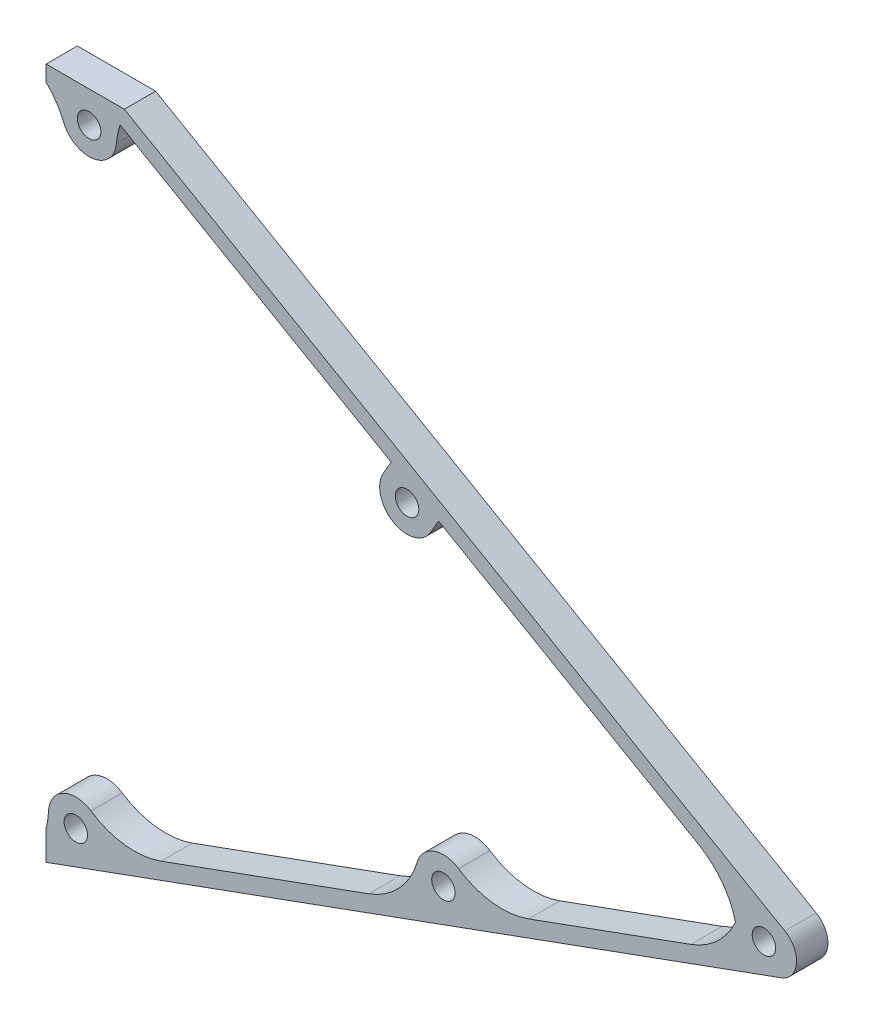
ISO-10303-21;
HEADER;
FILE_DESCRIPTION(('STEP AP214'),'2;1');
FILE_NAME('part.step','',(''),(''),'','','');
FILE_SCHEMA(('AUTOMOTIVE_DESIGN { 1 0 10303 214 1 1 1 1 }'));
ENDSEC;
DATA;
#1=APPLICATION_CONTEXT('core data for automotive mechanical design processes');
#2=APPLICATION_PROTOCOL_DEFINITION('international standard','automotive_design',2000,#1);
#3=PRODUCT_CONTEXT('',#1,'mechanical');
#4=PRODUCT('Part','Part','',(#3));
#5=PRODUCT_RELATED_PRODUCT_CATEGORY('part','',(#4));
#6=PRODUCT_DEFINITION_FORMATION('','',#4);
#7=PRODUCT_DEFINITION_CONTEXT('part definition',#1,'design');
#8=PRODUCT_DEFINITION('design','',#6,#7);
#9=PRODUCT_DEFINITION_SHAPE('','',#8);
#10=(LENGTH_UNIT() NAMED_UNIT(*) SI_UNIT(.MILLI.,.METRE.));
#11=(NAMED_UNIT(*) PLANE_ANGLE_UNIT() SI_UNIT($,.RADIAN.));
#12=(NAMED_UNIT(*) SI_UNIT($,.STERADIAN.) SOLID_ANGLE_UNIT());
#13=UNCERTAINTY_MEASURE_WITH_UNIT(LENGTH_MEASURE(1.E-05),#10,'distance_accuracy_value','');
#14=(GEOMETRIC_REPRESENTATION_CONTEXT(3) GLOBAL_UNCERTAINTY_ASSIGNED_CONTEXT((#13)) GLOBAL_UNIT_ASSIGNED_CONTEXT((#10,
#11,#12)) REPRESENTATION_CONTEXT('',''));
#15=CARTESIAN_POINT('',(0.,0.,0.));
#16=DIRECTION('',(0.,0.,1.));
#17=DIRECTION('',(1.,0.,0.));
#18=AXIS2_PLACEMENT_3D('',#15,#16,#17);
#19=CARTESIAN_POINT('',(-61.,61.2679491924311,4.));
#20=DIRECTION('',(0.5,0.866025403784439,0.));
#21=DIRECTION('',(-0.866025403784439,0.5,0.));
#22=AXIS2_PLACEMENT_3D('',#19,#20,#21);
#23=PLANE('',#22);
#24=DIRECTION('',(0.,0.,-1.));
#25=VECTOR('',#24,1.);
#26=CARTESIAN_POINT('',(-25.8948822334847,41.,14.2696803114159));
#27=LINE('',#26,#25);
#28=CARTESIAN_POINT('',(-25.8948822334847,41.,4.));
#29=VERTEX_POINT('',#28);
#30=CARTESIAN_POINT('',(-25.8948822334847,41.,0.));
#31=VERTEX_POINT('',#30);
#32=EDGE_CURVE('E357',#29,#31,#27,.T.);
#33=ORIENTED_EDGE('',*,*,#32,.F.);
#34=DIRECTION('',(0.866025403784439,-0.5,0.));
#35=VECTOR('',#34,1.);
#36=CARTESIAN_POINT('',(-61.,61.2679491924311,4.));
#37=LINE('',#36,#35);
#38=CARTESIAN_POINT('',(-60.5358983848622,61.,4.));
#39=VERTEX_POINT('',#38);
#40=EDGE_CURVE('E409',#39,#29,#37,.T.);
#41=ORIENTED_EDGE('',*,*,#40,.F.);
#42=DIRECTION('',(0.,0.,-1.));
#43=VECTOR('',#42,1.);
#44=CARTESIAN_POINT('',(-60.5358983848622,61.,4.));
#45=LINE('',#44,#43);
#46=CARTESIAN_POINT('',(-60.5358983848622,61.,0.));
#47=VERTEX_POINT('',#46);
#48=EDGE_CURVE('E412',#39,#47,#45,.T.);
#49=ORIENTED_EDGE('',*,*,#48,.T.);
#50=DIRECTION('',(0.866025403784439,-0.5,0.));
#51=VECTOR('',#50,1.);
#52=CARTESIAN_POINT('',(-61.,61.2679491924311,0.));
#53=LINE('',#52,#51);
#54=EDGE_CURVE('E397',#47,#31,#53,.T.);
#55=ORIENTED_EDGE('',*,*,#54,.T.);
#56=EDGE_LOOP('',(#33,#41,#49,#55));
#57=FACE_BOUND('',#56,.T.);
#58=ADVANCED_FACE('F58',(#57),#23,.F.);
#59=CARTESIAN_POINT('',(-19.8327044069936,37.5,0.));
#60=VERTEX_POINT('',#59);
#61=CARTESIAN_POINT('',(13.4168577865727,18.3033563171073,0.));
#62=VERTEX_POINT('',#61);
#63=EDGE_CURVE('E422',#60,#62,#53,.T.);
#64=ORIENTED_EDGE('',*,*,#63,.T.);
#65=DIRECTION('',(0.,0.,-1.));
#66=VECTOR('',#65,1.);
#67=CARTESIAN_POINT('',(13.4168577865727,18.3033563171073,4.));
#68=LINE('',#67,#66);
#69=CARTESIAN_POINT('',(13.4168577865727,18.3033563171073,4.));
#70=VERTEX_POINT('',#69);
#71=EDGE_CURVE('E254',#62,#70,#68,.F.);
#72=ORIENTED_EDGE('',*,*,#71,.T.);
#73=CARTESIAN_POINT('',(-19.8327044069936,37.5,4.));
#74=VERTEX_POINT('',#73);
#75=EDGE_CURVE('E408',#74,#70,#37,.T.);
#76=ORIENTED_EDGE('',*,*,#75,.F.);
#77=DIRECTION('',(0.,0.,-1.));
#78=VECTOR('',#77,1.);
#79=CARTESIAN_POINT('',(-19.8327044069936,37.5,14.2696803114159));
#80=LINE('',#79,#78);
#81=EDGE_CURVE('E354',#74,#60,#80,.T.);
#82=ORIENTED_EDGE('',*,*,#81,.T.);
#83=EDGE_LOOP('',(#64,#72,#76,#82));
#84=FACE_BOUND('',#83,.T.);
#85=ADVANCED_FACE('F471',(#84),#23,.F.);
#86=CARTESIAN_POINT('',(29.3159597133487,12.9178610145055,4.));
#87=DIRECTION('',(0.34202014332567,-0.939692620785908,0.));
#88=DIRECTION('',(0.939692620785908,0.34202014332567,0.));
#89=AXIS2_PLACEMENT_3D('',#86,#87,#88);
#90=PLANE('',#89);
#91=DIRECTION('',(-0.939692620785908,-0.34202014332567,0.));
#92=VECTOR('',#91,1.);
#93=CARTESIAN_POINT('',(29.3159597133487,12.9178610145055,4.));
#94=LINE('',#93,#92);
#95=CARTESIAN_POINT('',(-28.7495819952437,-8.21626780396493,4.));
#96=VERTEX_POINT('',#95);
#97=CARTESIAN_POINT('',(-55.2972487101186,-17.878828277399,4.));
#98=VERTEX_POINT('',#97);
#99=EDGE_CURVE('E393',#96,#98,#94,.T.);
#100=ORIENTED_EDGE('',*,*,#99,.F.);
#101=DIRECTION('',(0.,0.,-1.));
#102=VECTOR('',#101,1.);
#103=CARTESIAN_POINT('',(-28.7495819952437,-8.21626780396493,4.));
#104=LINE('',#103,#102);
#105=CARTESIAN_POINT('',(-28.7495819952437,-8.21626780396493,0.));
#106=VERTEX_POINT('',#105);
#107=EDGE_CURVE('E268',#96,#106,#104,.T.);
#108=ORIENTED_EDGE('',*,*,#107,.T.);
#109=DIRECTION('',(-0.939692620785908,-0.34202014332567,0.));
#110=VECTOR('',#109,1.);
#111=CARTESIAN_POINT('',(29.3159597133487,12.9178610145055,0.));
#112=LINE('',#111,#110);
#113=CARTESIAN_POINT('',(-55.2972487101186,-17.878828277399,0.));
#114=VERTEX_POINT('',#113);
#115=EDGE_CURVE('E392',#106,#114,#112,.T.);
#116=ORIENTED_EDGE('',*,*,#115,.T.);
#117=DIRECTION('',(0.,0.,-1.));
#118=VECTOR('',#117,1.);
#119=CARTESIAN_POINT('',(-55.2972487101186,-17.878828277399,4.));
#120=LINE('',#119,#118);
#121=EDGE_CURVE('E266',#114,#98,#120,.F.);
#122=ORIENTED_EDGE('',*,*,#121,.T.);
#123=EDGE_LOOP('',(#100,#108,#116,#122));
#124=FACE_BOUND('',#123,.T.);
#125=ADVANCED_FACE('F501',(#124),#90,.F.);
#126=CARTESIAN_POINT('',(12.4072597114491,6.76359751367714,4.));
#127=VERTEX_POINT('',#126);
#128=CARTESIAN_POINT('',(-8.31261767082319,-0.777821111115523,4.));
#129=VERTEX_POINT('',#128);
#130=EDGE_CURVE('E396',#127,#129,#94,.T.);
#131=ORIENTED_EDGE('',*,*,#130,.F.);
#132=DIRECTION('',(0.,0.,-1.));
#133=VECTOR('',#132,1.);
#134=CARTESIAN_POINT('',(12.4072597114491,6.76359751367714,4.));
#135=LINE('',#134,#133);
#136=CARTESIAN_POINT('',(12.4072597114491,6.76359751367714,0.));
#137=VERTEX_POINT('',#136);
#138=EDGE_CURVE('E259',#127,#137,#135,.T.);
#139=ORIENTED_EDGE('',*,*,#138,.T.);
#140=CARTESIAN_POINT('',(-8.31261767082319,-0.777821111115523,0.));
#141=VERTEX_POINT('',#140);
#142=EDGE_CURVE('E234',#137,#141,#112,.T.);
#143=ORIENTED_EDGE('',*,*,#142,.T.);
#144=DIRECTION('',(0.,0.,-1.));
#145=VECTOR('',#144,1.);
#146=CARTESIAN_POINT('',(-8.31261767082319,-0.777821111115523,4.));
#147=LINE('',#146,#145);
#148=EDGE_CURVE('E257',#141,#129,#147,.F.);
#149=ORIENTED_EDGE('',*,*,#148,.T.);
#150=EDGE_LOOP('',(#131,#139,#143,#149));
#151=FACE_BOUND('',#150,.T.);
#152=ADVANCED_FACE('F484',(#151),#90,.F.);
#153=CARTESIAN_POINT('',(30.,11.0384757729337,4.));
#154=DIRECTION('',(0.34202014332567,-0.939692620785908,0.));
#155=DIRECTION('',(0.939692620785908,0.34202014332567,0.));
#156=AXIS2_PLACEMENT_3D('',#153,#154,#155);
#157=PLANE('',#156);
#158=DIRECTION('',(-0.939692620785908,-0.34202014332567,0.));
#159=VECTOR('',#158,1.);
#160=CARTESIAN_POINT('',(30.,11.0384757729337,0.));
#161=LINE('',#160,#159);
#162=CARTESIAN_POINT('',(23.9544680147186,8.83808207998699,0.));
#163=VERTEX_POINT('',#162);
#164=CARTESIAN_POINT('',(-70.,-25.3585476536867,0.));
#165=VERTEX_POINT('',#164);
#166=EDGE_CURVE('E226',#163,#165,#161,.T.);
#167=ORIENTED_EDGE('',*,*,#166,.F.);
#168=DIRECTION('',(0.,0.,-1.));
#169=VECTOR('',#168,1.);
#170=CARTESIAN_POINT('',(23.9544680147186,8.83808207998699,4.));
#171=LINE('',#170,#169);
#172=CARTESIAN_POINT('',(23.9544680147186,8.83808207998699,4.));
#173=VERTEX_POINT('',#172);
#174=EDGE_CURVE('E250',#163,#173,#171,.F.);
#175=ORIENTED_EDGE('',*,*,#174,.T.);
#176=DIRECTION('',(-0.939692620785908,-0.34202014332567,0.));
#177=VECTOR('',#176,1.);
#178=CARTESIAN_POINT('',(30.,11.0384757729337,4.));
#179=LINE('',#178,#177);
#180=CARTESIAN_POINT('',(-70.,-25.3585476536867,4.));
#181=VERTEX_POINT('',#180);
#182=EDGE_CURVE('E239',#173,#181,#179,.T.);
#183=ORIENTED_EDGE('',*,*,#182,.T.);
#184=DIRECTION('',(0.,0.,-1.));
#185=VECTOR('',#184,1.);
#186=CARTESIAN_POINT('',(-70.,-25.3585476536867,4.));
#187=LINE('',#186,#185);
#188=EDGE_CURVE('E220',#181,#165,#187,.T.);
#189=ORIENTED_EDGE('',*,*,#188,.T.);
#190=EDGE_LOOP('',(#167,#175,#183,#189));
#191=FACE_BOUND('',#190,.T.);
#192=ADVANCED_FACE('F237',(#191),#157,.T.);
#193=CARTESIAN_POINT('',(-60.,63.,4.));
#194=DIRECTION('',(0.5,0.866025403784439,0.));
#195=DIRECTION('',(-0.866025403784439,0.5,0.));
#196=AXIS2_PLACEMENT_3D('',#193,#194,#195);
#197=PLANE('',#196);
#198=DIRECTION('',(0.866025403784439,-0.5,0.));
#199=VECTOR('',#198,1.);
#200=CARTESIAN_POINT('',(-60.,63.,4.));
#201=LINE('',#200,#199);
#202=CARTESIAN_POINT('',(-60.,63.,4.));
#203=VERTEX_POINT('',#202);
#204=CARTESIAN_POINT('',(24.4284075847416,14.255236153698,4.));
#205=VERTEX_POINT('',#204);
#206=EDGE_CURVE('E399',#203,#205,#201,.T.);
#207=ORIENTED_EDGE('',*,*,#206,.T.);
#208=DIRECTION('',(0.,0.,-1.));
#209=VECTOR('',#208,1.);
#210=CARTESIAN_POINT('',(24.4284075847416,14.255236153698,4.));
#211=LINE('',#210,#209);
#212=CARTESIAN_POINT('',(24.4284075847416,14.255236153698,0.));
#213=VERTEX_POINT('',#212);
#214=EDGE_CURVE('E240',#205,#213,#211,.T.);
#215=ORIENTED_EDGE('',*,*,#214,.T.);
#216=DIRECTION('',(0.866025403784439,-0.5,0.));
#217=VECTOR('',#216,1.);
#218=CARTESIAN_POINT('',(-60.,63.,0.));
#219=LINE('',#218,#217);
#220=CARTESIAN_POINT('',(-60.,63.,0.));
#221=VERTEX_POINT('',#220);
#222=EDGE_CURVE('E233',#221,#213,#219,.T.);
#223=ORIENTED_EDGE('',*,*,#222,.F.);
#224=DIRECTION('',(0.,0.,-1.));
#225=VECTOR('',#224,1.);
#226=CARTESIAN_POINT('',(-60.,63.,4.));
#227=LINE('',#226,#225);
#228=EDGE_CURVE('E241',#203,#221,#227,.T.);
#229=ORIENTED_EDGE('',*,*,#228,.F.);
#230=EDGE_LOOP('',(#207,#215,#223,#229));
#231=FACE_BOUND('',#230,.T.);
#232=ADVANCED_FACE('F522',(#231),#197,.T.);
#233=CARTESIAN_POINT('',(-60.,63.,4.));
#234=DIRECTION('',(0.,1.,0.));
#235=DIRECTION('',(0.,0.,1.));
#236=AXIS2_PLACEMENT_3D('',#233,#234,#235);
#237=PLANE('',#236);
#238=DIRECTION('',(1.,0.,0.));
#239=VECTOR('',#238,1.);
#240=CARTESIAN_POINT('',(-60.,63.,0.));
#241=LINE('',#240,#239);
#242=CARTESIAN_POINT('',(-70.,63.,0.));
#243=VERTEX_POINT('',#242);
#244=EDGE_CURVE('E416',#243,#221,#241,.T.);
#245=ORIENTED_EDGE('',*,*,#244,.F.);
#246=DIRECTION('',(0.,0.,-1.));
#247=VECTOR('',#246,1.);
#248=CARTESIAN_POINT('',(-70.,63.,4.));
#249=LINE('',#248,#247);
#250=CARTESIAN_POINT('',(-70.,63.,4.));
#251=VERTEX_POINT('',#250);
#252=EDGE_CURVE('E245',#251,#243,#249,.T.);
#253=ORIENTED_EDGE('',*,*,#252,.F.);
#254=DIRECTION('',(1.,0.,0.));
#255=VECTOR('',#254,1.);
#256=CARTESIAN_POINT('',(-60.,63.,4.));
#257=LINE('',#256,#255);
#258=EDGE_CURVE('E402',#251,#203,#257,.T.);
#259=ORIENTED_EDGE('',*,*,#258,.T.);
#260=ORIENTED_EDGE('',*,*,#228,.T.);
#261=EDGE_LOOP('',(#245,#253,#259,#260));
#262=FACE_BOUND('',#261,.T.);
#263=ADVANCED_FACE('F435',(#262),#237,.T.);
#264=CARTESIAN_POINT('',(-70.,61.,4.));
#265=DIRECTION('',(-1.,0.,0.));
#266=DIRECTION('',(0.,0.,1.));
#267=AXIS2_PLACEMENT_3D('',#264,#265,#266);
#268=PLANE('',#267);
#269=DIRECTION('',(0.,1.,0.));
#270=VECTOR('',#269,1.);
#271=CARTESIAN_POINT('',(-70.,61.,0.));
#272=LINE('',#271,#270);
#273=CARTESIAN_POINT('',(-70.,61.,0.));
#274=VERTEX_POINT('',#273);
#275=EDGE_CURVE('E419',#274,#243,#272,.T.);
#276=ORIENTED_EDGE('',*,*,#275,.F.);
#277=DIRECTION('',(0.,0.,-1.));
#278=VECTOR('',#277,1.);
#279=CARTESIAN_POINT('',(-70.,61.,4.));
#280=LINE('',#279,#278);
#281=CARTESIAN_POINT('',(-70.,61.,4.));
#282=VERTEX_POINT('',#281);
#283=EDGE_CURVE('E426',#282,#274,#280,.T.);
#284=ORIENTED_EDGE('',*,*,#283,.F.);
#285=DIRECTION('',(0.,1.,0.));
#286=VECTOR('',#285,1.);
#287=CARTESIAN_POINT('',(-70.,61.,4.));
#288=LINE('',#287,#286);
#289=EDGE_CURVE('E405',#282,#251,#288,.T.);
#290=ORIENTED_EDGE('',*,*,#289,.T.);
#291=ORIENTED_EDGE('',*,*,#252,.T.);
#292=EDGE_LOOP('',(#276,#284,#290,#291));
#293=FACE_BOUND('',#292,.T.);
#294=ADVANCED_FACE('F431',(#293),#268,.T.);
#295=CARTESIAN_POINT('',(0.,0.,4.));
#296=DIRECTION('',(0.,0.,-1.));
#297=DIRECTION('',(-1.,0.,0.));
#298=AXIS2_PLACEMENT_3D('',#295,#296,#297);
#299=PLANE('',#298);
#300=CARTESIAN_POINT('',(-79.6867494133173,-19.125861551774,4.));
#301=DIRECTION('',(0.,0.,-1.));
#302=DIRECTION('',(-1.,0.,0.));
#303=AXIS2_PLACEMENT_3D('',#300,#301,#302);
#304=CIRCLE('',#303,10.);
#305=CARTESIAN_POINT('',(-69.6963951508454,-19.5649762410169,4.));
#306=VERTEX_POINT('',#305);
#307=CARTESIAN_POINT('',(-70.,-21.6091830781971,4.));
#308=VERTEX_POINT('',#307);
#309=EDGE_CURVE('E302',#306,#308,#304,.T.);
#310=ORIENTED_EDGE('',*,*,#309,.T.);
#311=DIRECTION('',(0.,1.,0.));
#312=VECTOR('',#311,1.);
#313=CARTESIAN_POINT('',(-70.,-25.3585476536867,4.));
#314=LINE('',#313,#312);
#315=EDGE_CURVE('E73',#181,#308,#314,.T.);
#316=ORIENTED_EDGE('',*,*,#315,.F.);
#317=ORIENTED_EDGE('',*,*,#182,.F.);
#318=CARTESIAN_POINT('',(22.9284075847416,11.6571599423447,4.));
#319=DIRECTION('',(0.,0.,-1.));
#320=DIRECTION('',(-1.,0.,0.));
#321=AXIS2_PLACEMENT_3D('',#318,#319,#320);
#322=CIRCLE('',#321,3.);
#323=EDGE_CURVE('E252',#173,#205,#322,.F.);
#324=ORIENTED_EDGE('',*,*,#323,.T.);
#325=ORIENTED_EDGE('',*,*,#206,.F.);
#326=ORIENTED_EDGE('',*,*,#258,.F.);
#327=ORIENTED_EDGE('',*,*,#289,.F.);
#328=CARTESIAN_POINT('',(-76.9708627492164,53.830127439655,4.));
#329=DIRECTION('',(0.,0.,-1.));
#330=DIRECTION('',(-1.,0.,0.));
#331=AXIS2_PLACEMENT_3D('',#328,#329,#330);
#332=CIRCLE('',#331,10.);
#333=CARTESIAN_POINT('',(-67.7331866386857,57.6596626695402,4.));
#334=VERTEX_POINT('',#333);
#335=EDGE_CURVE('E66',#282,#334,#332,.T.);
#336=ORIENTED_EDGE('',*,*,#335,.T.);
#337=CARTESIAN_POINT('',(-64.5,59.,4.));
#338=DIRECTION('',(0.,0.,-1.));
#339=DIRECTION('',(-1.,0.,0.));
#340=AXIS2_PLACEMENT_3D('',#337,#338,#339);
#341=CIRCLE('',#340,3.50000000000001);
#342=CARTESIAN_POINT('',(-61.0130920058537,58.6975555582281,4.));
#343=VERTEX_POINT('',#342);
#344=EDGE_CURVE('E326',#334,#343,#341,.F.);
#345=ORIENTED_EDGE('',*,*,#344,.T.);
#346=CARTESIAN_POINT('',(-51.0504977368643,57.8334285817369,4.));
#347=DIRECTION('',(0.,0.,-1.));
#348=DIRECTION('',(-1.,0.,0.));
#349=AXIS2_PLACEMENT_3D('',#346,#347,#348);
#350=CIRCLE('',#349,10.);
#351=EDGE_CURVE('E307',#343,#39,#350,.T.);
#352=ORIENTED_EDGE('',*,*,#351,.T.);
#353=ORIENTED_EDGE('',*,*,#40,.T.);
#354=DIRECTION('',(0.499999999999999,0.86602540378444,0.));
#355=VECTOR('',#354,1.);
#356=CARTESIAN_POINT('',(-37.1746824526945,21.4628129211019,4.));
#357=LINE('',#356,#355);
#358=CARTESIAN_POINT('',(-26.8948822334847,39.2679491924311,4.));
#359=VERTEX_POINT('',#358);
#360=EDGE_CURVE('E334',#359,#29,#357,.T.);
#361=ORIENTED_EDGE('',*,*,#360,.F.);
#362=CARTESIAN_POINT('',(-23.8637933202392,37.5179491924311,4.));
#363=DIRECTION('',(0.,0.,-1.));
#364=DIRECTION('',(-1.,0.,0.));
#365=AXIS2_PLACEMENT_3D('',#362,#363,#364);
#366=CIRCLE('',#365,3.5);
#367=CARTESIAN_POINT('',(-20.8327044069936,35.7679491924311,4.));
#368=VERTEX_POINT('',#367);
#369=EDGE_CURVE('E333',#359,#368,#366,.F.);
#370=ORIENTED_EDGE('',*,*,#369,.T.);
#371=DIRECTION('',(0.499999999999995,0.866025403784442,0.));
#372=VECTOR('',#371,1.);
#373=CARTESIAN_POINT('',(-31.1125046262034,17.9628129211018,4.));
#374=LINE('',#373,#372);
#375=EDGE_CURVE('E330',#368,#74,#374,.T.);
#376=ORIENTED_EDGE('',*,*,#375,.T.);
#377=ORIENTED_EDGE('',*,*,#75,.T.);
#378=CARTESIAN_POINT('',(8.41685778657267,9.64310227926294,4.));
#379=DIRECTION('',(0.,0.,-1.));
#380=DIRECTION('',(-1.,0.,0.));
#381=AXIS2_PLACEMENT_3D('',#378,#379,#380);
#382=CIRCLE('',#381,10.);
#383=CARTESIAN_POINT('',(18.1158409765538,12.0782049630245,4.));
#384=VERTEX_POINT('',#383);
#385=EDGE_CURVE('E80',#70,#384,#382,.T.);
#386=ORIENTED_EDGE('',*,*,#385,.T.);
#387=CARTESIAN_POINT('',(8.98705827819236,16.1605237215362,4.));
#388=DIRECTION('',(0.,0.,-1.));
#389=DIRECTION('',(-1.,0.,0.));
#390=AXIS2_PLACEMENT_3D('',#387,#388,#389);
#391=CIRCLE('',#390,10.);
#392=EDGE_CURVE('E286',#384,#127,#391,.T.);
#393=ORIENTED_EDGE('',*,*,#392,.T.);
#394=ORIENTED_EDGE('',*,*,#130,.T.);
#395=CARTESIAN_POINT('',(-11.7328191040799,8.61910509674355,4.));
#396=DIRECTION('',(0.,0.,-1.));
#397=DIRECTION('',(-1.,0.,0.));
#398=AXIS2_PLACEMENT_3D('',#395,#396,#397);
#399=CIRCLE('',#398,10.);
#400=CARTESIAN_POINT('',(-17.2752791156391,0.295575976216174,4.));
#401=VERTEX_POINT('',#400);
#402=EDGE_CURVE('E290',#129,#401,#399,.T.);
#403=ORIENTED_EDGE('',*,*,#402,.T.);
#404=CARTESIAN_POINT('',(-19.2151401196848,-2.61765921596841,4.));
#405=DIRECTION('',(0.,0.,-1.));
#406=DIRECTION('',(-1.,0.,0.));
#407=AXIS2_PLACEMENT_3D('',#404,#405,#406);
#408=CIRCLE('',#407,3.50000000000001);
#409=CARTESIAN_POINT('',(-22.5737513478963,-1.63291020341145,4.));
#410=VERTEX_POINT('',#409);
#411=EDGE_CURVE('E372',#401,#410,#408,.F.);
#412=ORIENTED_EDGE('',*,*,#411,.T.);
#413=CARTESIAN_POINT('',(-32.1697834285005,1.18065840389415,4.));
#414=DIRECTION('',(0.,0.,-1.));
#415=DIRECTION('',(-1.,0.,0.));
#416=AXIS2_PLACEMENT_3D('',#413,#414,#415);
#417=CIRCLE('',#416,10.);
#418=EDGE_CURVE('E294',#410,#96,#417,.T.);
#419=ORIENTED_EDGE('',*,*,#418,.T.);
#420=ORIENTED_EDGE('',*,*,#99,.T.);
#421=CARTESIAN_POINT('',(-58.7174501433753,-8.48190206953997,4.));
#422=DIRECTION('',(0.,0.,-1.));
#423=DIRECTION('',(-1.,0.,0.));
#424=AXIS2_PLACEMENT_3D('',#421,#422,#423);
#425=CIRCLE('',#424,10.);
#426=CARTESIAN_POINT('',(-64.2599101549345,-16.8054311900673,4.));
#427=VERTEX_POINT('',#426);
#428=EDGE_CURVE('E298',#98,#427,#425,.T.);
#429=ORIENTED_EDGE('',*,*,#428,.T.);
#430=CARTESIAN_POINT('',(-66.1997711589802,-19.7186663822519,4.));
#431=DIRECTION('',(0.,0.,-1.));
#432=DIRECTION('',(-1.,0.,0.));
#433=AXIS2_PLACEMENT_3D('',#430,#431,#432);
#434=CIRCLE('',#433,3.50000000000001);
#435=EDGE_CURVE('E384',#427,#306,#434,.F.);
#436=ORIENTED_EDGE('',*,*,#435,.T.);
#437=EDGE_LOOP('',(#310,#316,#317,#324,#325,#326,#327,#336,#345,#352,#353,#361,#370,#376,#377,
#386,#393,#394,#403,#412,#419,#420,#429,#436));
#438=FACE_BOUND('',#437,.T.);
#439=CARTESIAN_POINT('',(21.7498088488651,11.7602739705799,4.));
#440=DIRECTION('',(0.,0.,-1.));
#441=DIRECTION('',(-1.,0.,0.));
#442=AXIS2_PLACEMENT_3D('',#439,#440,#441);
#443=CIRCLE('',#442,1.5);
#444=CARTESIAN_POINT('',(20.2498088488651,11.7602739705799,4.));
#445=VERTEX_POINT('',#444);
#446=EDGE_CURVE('E363',#445,#445,#443,.F.);
#447=ORIENTED_EDGE('',*,*,#446,.F.);
#448=EDGE_LOOP('',(#447));
#449=FACE_BOUND('',#448,.T.);
#450=CARTESIAN_POINT('',(-66.1997711589802,-19.7186663822519,4.));
#451=DIRECTION('',(0.,0.,-1.));
#452=DIRECTION('',(-1.,0.,0.));
#453=AXIS2_PLACEMENT_3D('',#450,#451,#452);
#454=CIRCLE('',#453,1.5);
#455=CARTESIAN_POINT('',(-67.6997711589802,-19.7186663822519,4.));
#456=VERTEX_POINT('',#455);
#457=EDGE_CURVE('E380',#456,#456,#454,.F.);
#458=ORIENTED_EDGE('',*,*,#457,.F.);
#459=EDGE_LOOP('',(#458));
#460=FACE_BOUND('',#459,.T.);
#461=CARTESIAN_POINT('',(-19.2151401196848,-2.61765921596841,4.));
#462=DIRECTION('',(0.,0.,-1.));
#463=DIRECTION('',(-1.,0.,0.));
#464=AXIS2_PLACEMENT_3D('',#461,#462,#463);
#465=CIRCLE('',#464,1.5);
#466=CARTESIAN_POINT('',(-20.7151401196848,-2.61765921596841,4.));
#467=VERTEX_POINT('',#466);
#468=EDGE_CURVE('E366',#467,#467,#465,.F.);
#469=ORIENTED_EDGE('',*,*,#468,.F.);
#470=EDGE_LOOP('',(#469));
#471=FACE_BOUND('',#470,.T.);
#472=CARTESIAN_POINT('',(-23.8637933202392,37.5179491924311,4.));
#473=DIRECTION('',(0.,0.,-1.));
#474=DIRECTION('',(-1.,0.,0.));
#475=AXIS2_PLACEMENT_3D('',#472,#473,#474);
#476=CIRCLE('',#475,1.5);
#477=CARTESIAN_POINT('',(-25.3637933202392,37.5179491924311,4.));
#478=VERTEX_POINT('',#477);
#479=EDGE_CURVE('E336',#478,#478,#476,.F.);
#480=ORIENTED_EDGE('',*,*,#479,.F.);
#481=EDGE_LOOP('',(#480));
#482=FACE_BOUND('',#481,.T.);
#483=CARTESIAN_POINT('',(-64.5,59.,4.));
#484=DIRECTION('',(0.,0.,-1.));
#485=DIRECTION('',(-1.,0.,0.));
#486=AXIS2_PLACEMENT_3D('',#483,#484,#485);
#487=CIRCLE('',#486,1.5);
#488=CARTESIAN_POINT('',(-66.,59.,4.));
#489=VERTEX_POINT('',#488);
#490=EDGE_CURVE('E312',#489,#489,#487,.F.);
#491=ORIENTED_EDGE('',*,*,#490,.F.);
#492=EDGE_LOOP('',(#491));
#493=FACE_BOUND('',#492,.T.);
#494=ADVANCED_FACE('F447',(#438,#449,#460,#471,#482,#493),#299,.F.);
#495=CARTESIAN_POINT('',(0.,0.,0.));
#496=DIRECTION('',(0.,0.,-1.));
#497=DIRECTION('',(-1.,0.,0.));
#498=AXIS2_PLACEMENT_3D('',#495,#496,#497);
#499=PLANE('',#498);
#500=DIRECTION('',(0.,1.,0.));
#501=VECTOR('',#500,1.);
#502=CARTESIAN_POINT('',(-70.,-25.3585476536867,0.));
#503=LINE('',#502,#501);
#504=CARTESIAN_POINT('',(-70.,-21.6091830781971,0.));
#505=VERTEX_POINT('',#504);
#506=EDGE_CURVE('E216',#165,#505,#503,.T.);
#507=ORIENTED_EDGE('',*,*,#506,.T.);
#508=CARTESIAN_POINT('',(-79.6867494133173,-19.125861551774,0.));
#509=DIRECTION('',(0.,0.,-1.));
#510=DIRECTION('',(-1.,0.,0.));
#511=AXIS2_PLACEMENT_3D('',#508,#509,#510);
#512=CIRCLE('',#511,10.);
#513=CARTESIAN_POINT('',(-69.6963951508454,-19.5649762410169,0.));
#514=VERTEX_POINT('',#513);
#515=EDGE_CURVE('E300',#505,#514,#512,.F.);
#516=ORIENTED_EDGE('',*,*,#515,.T.);
#517=CARTESIAN_POINT('',(-66.1997711589802,-19.7186663822519,0.));
#518=DIRECTION('',(0.,0.,-1.));
#519=DIRECTION('',(-1.,0.,0.));
#520=AXIS2_PLACEMENT_3D('',#517,#518,#519);
#521=CIRCLE('',#520,3.50000000000001);
#522=CARTESIAN_POINT('',(-64.2599101549345,-16.8054311900673,0.));
#523=VERTEX_POINT('',#522);
#524=EDGE_CURVE('E381',#514,#523,#521,.T.);
#525=ORIENTED_EDGE('',*,*,#524,.T.);
#526=CARTESIAN_POINT('',(-58.7174501433753,-8.48190206953997,0.));
#527=DIRECTION('',(0.,0.,-1.));
#528=DIRECTION('',(-1.,0.,0.));
#529=AXIS2_PLACEMENT_3D('',#526,#527,#528);
#530=CIRCLE('',#529,10.);
#531=EDGE_CURVE('E296',#523,#114,#530,.F.);
#532=ORIENTED_EDGE('',*,*,#531,.T.);
#533=ORIENTED_EDGE('',*,*,#115,.F.);
#534=CARTESIAN_POINT('',(-32.1697834285005,1.18065840389415,0.));
#535=DIRECTION('',(0.,0.,-1.));
#536=DIRECTION('',(-1.,0.,0.));
#537=AXIS2_PLACEMENT_3D('',#534,#535,#536);
#538=CIRCLE('',#537,10.);
#539=CARTESIAN_POINT('',(-22.5737513478963,-1.63291020341145,0.));
#540=VERTEX_POINT('',#539);
#541=EDGE_CURVE('E292',#106,#540,#538,.F.);
#542=ORIENTED_EDGE('',*,*,#541,.T.);
#543=CARTESIAN_POINT('',(-19.2151401196848,-2.61765921596841,0.));
#544=DIRECTION('',(0.,0.,-1.));
#545=DIRECTION('',(-1.,0.,0.));
#546=AXIS2_PLACEMENT_3D('',#543,#544,#545);
#547=CIRCLE('',#546,3.50000000000001);
#548=CARTESIAN_POINT('',(-17.2752791156391,0.295575976216174,0.));
#549=VERTEX_POINT('',#548);
#550=EDGE_CURVE('E369',#540,#549,#547,.T.);
#551=ORIENTED_EDGE('',*,*,#550,.T.);
#552=CARTESIAN_POINT('',(-11.7328191040799,8.61910509674355,0.));
#553=DIRECTION('',(0.,0.,-1.));
#554=DIRECTION('',(-1.,0.,0.));
#555=AXIS2_PLACEMENT_3D('',#552,#553,#554);
#556=CIRCLE('',#555,10.);
#557=EDGE_CURVE('E288',#549,#141,#556,.F.);
#558=ORIENTED_EDGE('',*,*,#557,.T.);
#559=ORIENTED_EDGE('',*,*,#142,.F.);
#560=CARTESIAN_POINT('',(8.98705827819236,16.1605237215362,0.));
#561=DIRECTION('',(0.,0.,-1.));
#562=DIRECTION('',(-1.,0.,0.));
#563=AXIS2_PLACEMENT_3D('',#560,#561,#562);
#564=CIRCLE('',#563,10.);
#565=CARTESIAN_POINT('',(18.1158409765538,12.0782049630245,0.));
#566=VERTEX_POINT('',#565);
#567=EDGE_CURVE('E284',#137,#566,#564,.F.);
#568=ORIENTED_EDGE('',*,*,#567,.T.);
#569=CARTESIAN_POINT('',(8.41685778657267,9.64310227926294,0.));
#570=DIRECTION('',(0.,0.,-1.));
#571=DIRECTION('',(-1.,0.,0.));
#572=AXIS2_PLACEMENT_3D('',#569,#570,#571);
#573=CIRCLE('',#572,10.);
#574=EDGE_CURVE('E281',#566,#62,#573,.F.);
#575=ORIENTED_EDGE('',*,*,#574,.T.);
#576=ORIENTED_EDGE('',*,*,#63,.F.);
#577=DIRECTION('',(-0.499999999999995,-0.866025403784442,0.));
#578=VECTOR('',#577,1.);
#579=CARTESIAN_POINT('',(-31.1125046262034,17.9628129211018,0.));
#580=LINE('',#579,#578);
#581=CARTESIAN_POINT('',(-20.8327044069936,35.7679491924311,0.));
#582=VERTEX_POINT('',#581);
#583=EDGE_CURVE('E348',#60,#582,#580,.T.);
#584=ORIENTED_EDGE('',*,*,#583,.T.);
#585=CARTESIAN_POINT('',(-23.8637933202392,37.5179491924311,0.));
#586=DIRECTION('',(0.,0.,-1.));
#587=DIRECTION('',(-1.,0.,0.));
#588=AXIS2_PLACEMENT_3D('',#585,#586,#587);
#589=CIRCLE('',#588,3.5);
#590=CARTESIAN_POINT('',(-26.8948822334847,39.2679491924311,0.));
#591=VERTEX_POINT('',#590);
#592=EDGE_CURVE('E342',#582,#591,#589,.T.);
#593=ORIENTED_EDGE('',*,*,#592,.T.);
#594=DIRECTION('',(-0.499999999999999,-0.86602540378444,0.));
#595=VECTOR('',#594,1.);
#596=CARTESIAN_POINT('',(-37.1746824526945,21.4628129211019,0.));
#597=LINE('',#596,#595);
#598=EDGE_CURVE('E345',#31,#591,#597,.T.);
#599=ORIENTED_EDGE('',*,*,#598,.F.);
#600=ORIENTED_EDGE('',*,*,#54,.F.);
#601=CARTESIAN_POINT('',(-51.0504977368643,57.8334285817369,0.));
#602=DIRECTION('',(0.,0.,-1.));
#603=DIRECTION('',(-1.,0.,0.));
#604=AXIS2_PLACEMENT_3D('',#601,#602,#603);
#605=CIRCLE('',#604,10.);
#606=CARTESIAN_POINT('',(-61.0130920058537,58.6975555582281,0.));
#607=VERTEX_POINT('',#606);
#608=EDGE_CURVE('E305',#47,#607,#605,.F.);
#609=ORIENTED_EDGE('',*,*,#608,.T.);
#610=CARTESIAN_POINT('',(-64.5,59.,0.));
#611=DIRECTION('',(0.,0.,-1.));
#612=DIRECTION('',(-1.,0.,0.));
#613=AXIS2_PLACEMENT_3D('',#610,#611,#612);
#614=CIRCLE('',#613,3.50000000000001);
#615=CARTESIAN_POINT('',(-67.7331866386857,57.6596626695402,0.));
#616=VERTEX_POINT('',#615);
#617=EDGE_CURVE('E322',#607,#616,#614,.T.);
#618=ORIENTED_EDGE('',*,*,#617,.T.);
#619=CARTESIAN_POINT('',(-76.9708627492164,53.830127439655,0.));
#620=DIRECTION('',(0.,0.,-1.));
#621=DIRECTION('',(-1.,0.,0.));
#622=AXIS2_PLACEMENT_3D('',#619,#620,#621);
#623=CIRCLE('',#622,10.);
#624=EDGE_CURVE('E309',#616,#274,#623,.F.);
#625=ORIENTED_EDGE('',*,*,#624,.T.);
#626=ORIENTED_EDGE('',*,*,#275,.T.);
#627=ORIENTED_EDGE('',*,*,#244,.T.);
#628=ORIENTED_EDGE('',*,*,#222,.T.);
#629=CARTESIAN_POINT('',(22.9284075847416,11.6571599423447,0.));
#630=DIRECTION('',(0.,0.,-1.));
#631=DIRECTION('',(-1.,0.,0.));
#632=AXIS2_PLACEMENT_3D('',#629,#630,#631);
#633=CIRCLE('',#632,3.);
#634=EDGE_CURVE('E230',#213,#163,#633,.T.);
#635=ORIENTED_EDGE('',*,*,#634,.T.);
#636=ORIENTED_EDGE('',*,*,#166,.T.);
#637=EDGE_LOOP('',(#507,#516,#525,#532,#533,#542,#551,#558,#559,#568,#575,#576,#584,#593,#599,
#600,#609,#618,#625,#626,#627,#628,#635,#636));
#638=FACE_BOUND('',#637,.T.);
#639=CARTESIAN_POINT('',(21.7498088488651,11.7602739705799,0.));
#640=DIRECTION('',(0.,0.,-1.));
#641=DIRECTION('',(-1.,0.,0.));
#642=AXIS2_PLACEMENT_3D('',#639,#640,#641);
#643=CIRCLE('',#642,1.5);
#644=CARTESIAN_POINT('',(20.2498088488651,11.7602739705799,0.));
#645=VERTEX_POINT('',#644);
#646=EDGE_CURVE('E339',#645,#645,#643,.T.);
#647=ORIENTED_EDGE('',*,*,#646,.F.);
#648=EDGE_LOOP('',(#647));
#649=FACE_BOUND('',#648,.T.);
#650=CARTESIAN_POINT('',(-66.1997711589802,-19.7186663822519,0.));
#651=DIRECTION('',(0.,0.,-1.));
#652=DIRECTION('',(-1.,0.,0.));
#653=AXIS2_PLACEMENT_3D('',#650,#651,#652);
#654=CIRCLE('',#653,1.5);
#655=CARTESIAN_POINT('',(-67.6997711589802,-19.7186663822519,0.));
#656=VERTEX_POINT('',#655);
#657=EDGE_CURVE('E385',#656,#656,#654,.T.);
#658=ORIENTED_EDGE('',*,*,#657,.F.);
#659=EDGE_LOOP('',(#658));
#660=FACE_BOUND('',#659,.T.);
#661=CARTESIAN_POINT('',(-19.2151401196848,-2.61765921596841,0.));
#662=DIRECTION('',(0.,0.,-1.));
#663=DIRECTION('',(-1.,0.,0.));
#664=AXIS2_PLACEMENT_3D('',#661,#662,#663);
#665=CIRCLE('',#664,1.5);
#666=CARTESIAN_POINT('',(-20.7151401196848,-2.61765921596841,0.));
#667=VERTEX_POINT('',#666);
#668=EDGE_CURVE('E373',#667,#667,#665,.T.);
#669=ORIENTED_EDGE('',*,*,#668,.F.);
#670=EDGE_LOOP('',(#669));
#671=FACE_BOUND('',#670,.T.);
#672=CARTESIAN_POINT('',(-23.8637933202392,37.5179491924311,0.));
#673=DIRECTION('',(0.,0.,-1.));
#674=DIRECTION('',(-1.,0.,0.));
#675=AXIS2_PLACEMENT_3D('',#672,#673,#674);
#676=CIRCLE('',#675,1.5);
#677=CARTESIAN_POINT('',(-25.3637933202392,37.5179491924311,0.));
#678=VERTEX_POINT('',#677);
#679=EDGE_CURVE('E329',#678,#678,#676,.T.);
#680=ORIENTED_EDGE('',*,*,#679,.F.);
#681=EDGE_LOOP('',(#680));
#682=FACE_BOUND('',#681,.T.);
#683=CARTESIAN_POINT('',(-64.5,59.,0.));
#684=DIRECTION('',(0.,0.,-1.));
#685=DIRECTION('',(-1.,0.,0.));
#686=AXIS2_PLACEMENT_3D('',#683,#684,#685);
#687=CIRCLE('',#686,1.5);
#688=CARTESIAN_POINT('',(-66.,59.,0.));
#689=VERTEX_POINT('',#688);
#690=EDGE_CURVE('E317',#689,#689,#687,.T.);
#691=ORIENTED_EDGE('',*,*,#690,.F.);
#692=EDGE_LOOP('',(#691));
#693=FACE_BOUND('',#692,.T.);
#694=ADVANCED_FACE('F227',(#638,#649,#660,#671,#682,#693),#499,.T.);
#695=CARTESIAN_POINT('',(-66.1997711589802,-19.7186663822519,14.2696803114159));
#696=DIRECTION('',(0.,0.,-1.));
#697=DIRECTION('',(-1.,0.,0.));
#698=AXIS2_PLACEMENT_3D('',#695,#696,#697);
#699=CYLINDRICAL_SURFACE('',#698,3.50000000000001);
#700=ORIENTED_EDGE('',*,*,#435,.F.);
#701=DIRECTION('',(0.,0.,-1.));
#702=VECTOR('',#701,1.);
#703=CARTESIAN_POINT('',(-64.2599101549345,-16.8054311900673,14.2696803114159));
#704=LINE('',#703,#702);
#705=EDGE_CURVE('E273',#427,#523,#704,.T.);
#706=ORIENTED_EDGE('',*,*,#705,.T.);
#707=ORIENTED_EDGE('',*,*,#524,.F.);
#708=DIRECTION('',(0.,0.,-1.));
#709=VECTOR('',#708,1.);
#710=CARTESIAN_POINT('',(-69.6963951508454,-19.5649762410169,14.2696803114159));
#711=LINE('',#710,#709);
#712=EDGE_CURVE('E271',#514,#306,#711,.F.);
#713=ORIENTED_EDGE('',*,*,#712,.T.);
#714=EDGE_LOOP('',(#700,#706,#707,#713));
#715=FACE_BOUND('',#714,.T.);
#716=ADVANCED_FACE('F510',(#715),#699,.T.);
#717=CARTESIAN_POINT('',(-66.1997711589802,-19.7186663822519,14.2696803114159));
#718=DIRECTION('',(0.,0.,-1.));
#719=DIRECTION('',(-1.,0.,0.));
#720=AXIS2_PLACEMENT_3D('',#717,#718,#719);
#721=CYLINDRICAL_SURFACE('',#720,1.5);
#722=ORIENTED_EDGE('',*,*,#457,.T.);
#723=EDGE_LOOP('',(#722));
#724=FACE_BOUND('',#723,.T.);
#725=ORIENTED_EDGE('',*,*,#657,.T.);
#726=EDGE_LOOP('',(#725));
#727=FACE_BOUND('',#726,.T.);
#728=ADVANCED_FACE('F553',(#724,#727),#721,.F.);
#729=CARTESIAN_POINT('',(-19.2151401196848,-2.61765921596841,14.2696803114159));
#730=DIRECTION('',(0.,0.,-1.));
#731=DIRECTION('',(-1.,0.,0.));
#732=AXIS2_PLACEMENT_3D('',#729,#730,#731);
#733=CYLINDRICAL_SURFACE('',#732,3.50000000000001);
#734=ORIENTED_EDGE('',*,*,#411,.F.);
#735=DIRECTION('',(0.,0.,-1.));
#736=VECTOR('',#735,1.);
#737=CARTESIAN_POINT('',(-17.2752791156391,0.295575976216174,14.2696803114159));
#738=LINE('',#737,#736);
#739=EDGE_CURVE('E263',#401,#549,#738,.T.);
#740=ORIENTED_EDGE('',*,*,#739,.T.);
#741=ORIENTED_EDGE('',*,*,#550,.F.);
#742=DIRECTION('',(0.,0.,-1.));
#743=VECTOR('',#742,1.);
#744=CARTESIAN_POINT('',(-22.5737513478963,-1.63291020341145,14.2696803114159));
#745=LINE('',#744,#743);
#746=EDGE_CURVE('E261',#540,#410,#745,.F.);
#747=ORIENTED_EDGE('',*,*,#746,.T.);
#748=EDGE_LOOP('',(#734,#740,#741,#747));
#749=FACE_BOUND('',#748,.T.);
#750=ADVANCED_FACE('F492',(#749),#733,.T.);
#751=CARTESIAN_POINT('',(-19.2151401196848,-2.61765921596841,14.2696803114159));
#752=DIRECTION('',(0.,0.,-1.));
#753=DIRECTION('',(-1.,0.,0.));
#754=AXIS2_PLACEMENT_3D('',#751,#752,#753);
#755=CYLINDRICAL_SURFACE('',#754,1.5);
#756=ORIENTED_EDGE('',*,*,#468,.T.);
#757=EDGE_LOOP('',(#756));
#758=FACE_BOUND('',#757,.T.);
#759=ORIENTED_EDGE('',*,*,#668,.T.);
#760=EDGE_LOOP('',(#759));
#761=FACE_BOUND('',#760,.T.);
#762=ADVANCED_FACE('F559',(#758,#761),#755,.F.);
#763=CARTESIAN_POINT('',(21.7498088488651,11.7602739705799,14.2696803114159));
#764=DIRECTION('',(0.,0.,-1.));
#765=DIRECTION('',(-1.,0.,0.));
#766=AXIS2_PLACEMENT_3D('',#763,#764,#765);
#767=CYLINDRICAL_SURFACE('',#766,1.5);
#768=ORIENTED_EDGE('',*,*,#646,.T.);
#769=EDGE_LOOP('',(#768));
#770=FACE_BOUND('',#769,.T.);
#771=ORIENTED_EDGE('',*,*,#446,.T.);
#772=EDGE_LOOP('',(#771));
#773=FACE_BOUND('',#772,.T.);
#774=ADVANCED_FACE('F562',(#770,#773),#767,.F.);
#775=CARTESIAN_POINT('',(-23.8637933202392,37.5179491924311,14.2696803114159));
#776=DIRECTION('',(0.,0.,-1.));
#777=DIRECTION('',(-1.,0.,0.));
#778=AXIS2_PLACEMENT_3D('',#775,#776,#777);
#779=CYLINDRICAL_SURFACE('',#778,1.5);
#780=ORIENTED_EDGE('',*,*,#479,.T.);
#781=EDGE_LOOP('',(#780));
#782=FACE_BOUND('',#781,.T.);
#783=ORIENTED_EDGE('',*,*,#679,.T.);
#784=EDGE_LOOP('',(#783));
#785=FACE_BOUND('',#784,.T.);
#786=ADVANCED_FACE('F566',(#782,#785),#779,.F.);
#787=CARTESIAN_POINT('',(-37.1746824526945,21.4628129211019,14.2696803114159));
#788=DIRECTION('',(0.866025403784439,-0.499999999999998,0.));
#789=DIRECTION('',(0.499999999999999,0.86602540378444,0.));
#790=AXIS2_PLACEMENT_3D('',#787,#788,#789);
#791=PLANE('',#790);
#792=DIRECTION('',(0.,0.,-1.));
#793=VECTOR('',#792,1.);
#794=CARTESIAN_POINT('',(-26.8948822334847,39.2679491924311,14.2696803114159));
#795=LINE('',#794,#793);
#796=EDGE_CURVE('E351',#359,#591,#795,.T.);
#797=ORIENTED_EDGE('',*,*,#796,.F.);
#798=ORIENTED_EDGE('',*,*,#360,.T.);
#799=ORIENTED_EDGE('',*,*,#32,.T.);
#800=ORIENTED_EDGE('',*,*,#598,.T.);
#801=EDGE_LOOP('',(#797,#798,#799,#800));
#802=FACE_BOUND('',#801,.T.);
#803=ADVANCED_FACE('F459',(#802),#791,.F.);
#804=CARTESIAN_POINT('',(-31.1125046262034,17.9628129211018,14.2696803114159));
#805=DIRECTION('',(0.866025403784442,-0.499999999999995,0.));
#806=DIRECTION('',(0.499999999999995,0.866025403784442,0.));
#807=AXIS2_PLACEMENT_3D('',#804,#805,#806);
#808=PLANE('',#807);
#809=ORIENTED_EDGE('',*,*,#375,.F.);
#810=DIRECTION('',(0.,0.,-1.));
#811=VECTOR('',#810,1.);
#812=CARTESIAN_POINT('',(-20.8327044069936,35.7679491924311,14.2696803114159));
#813=LINE('',#812,#811);
#814=EDGE_CURVE('E352',#368,#582,#813,.T.);
#815=ORIENTED_EDGE('',*,*,#814,.T.);
#816=ORIENTED_EDGE('',*,*,#583,.F.);
#817=ORIENTED_EDGE('',*,*,#81,.F.);
#818=EDGE_LOOP('',(#809,#815,#816,#817));
#819=FACE_BOUND('',#818,.T.);
#820=ADVANCED_FACE('F468',(#819),#808,.T.);
#821=CARTESIAN_POINT('',(-23.8637933202392,37.5179491924311,14.2696803114159));
#822=DIRECTION('',(0.,0.,-1.));
#823=DIRECTION('',(-1.,0.,0.));
#824=AXIS2_PLACEMENT_3D('',#821,#822,#823);
#825=CYLINDRICAL_SURFACE('',#824,3.5);
#826=ORIENTED_EDGE('',*,*,#369,.F.);
#827=ORIENTED_EDGE('',*,*,#796,.T.);
#828=ORIENTED_EDGE('',*,*,#592,.F.);
#829=ORIENTED_EDGE('',*,*,#814,.F.);
#830=EDGE_LOOP('',(#826,#827,#828,#829));
#831=FACE_BOUND('',#830,.T.);
#832=ADVANCED_FACE('F463',(#831),#825,.T.);
#833=CARTESIAN_POINT('',(-64.5,59.,14.2696803114159));
#834=DIRECTION('',(0.,0.,-1.));
#835=DIRECTION('',(-1.,0.,0.));
#836=AXIS2_PLACEMENT_3D('',#833,#834,#835);
#837=CYLINDRICAL_SURFACE('',#836,3.50000000000001);
#838=ORIENTED_EDGE('',*,*,#617,.F.);
#839=DIRECTION('',(0.,0.,-1.));
#840=VECTOR('',#839,1.);
#841=CARTESIAN_POINT('',(-61.0130920058537,58.6975555582281,14.2696803114159));
#842=LINE('',#841,#840);
#843=EDGE_CURVE('E279',#607,#343,#842,.F.);
#844=ORIENTED_EDGE('',*,*,#843,.T.);
#845=ORIENTED_EDGE('',*,*,#344,.F.);
#846=DIRECTION('',(0.,0.,-1.));
#847=VECTOR('',#846,1.);
#848=CARTESIAN_POINT('',(-67.7331866386857,57.6596626695402,14.2696803114159));
#849=LINE('',#848,#847);
#850=EDGE_CURVE('E276',#334,#616,#849,.T.);
#851=ORIENTED_EDGE('',*,*,#850,.T.);
#852=EDGE_LOOP('',(#838,#844,#845,#851));
#853=FACE_BOUND('',#852,.T.);
#854=ADVANCED_FACE('F444',(#853),#837,.T.);
#855=CARTESIAN_POINT('',(-64.5,59.,14.2696803114159));
#856=DIRECTION('',(0.,0.,-1.));
#857=DIRECTION('',(-1.,0.,0.));
#858=AXIS2_PLACEMENT_3D('',#855,#856,#857);
#859=CYLINDRICAL_SURFACE('',#858,1.5);
#860=ORIENTED_EDGE('',*,*,#490,.T.);
#861=EDGE_LOOP('',(#860));
#862=FACE_BOUND('',#861,.T.);
#863=ORIENTED_EDGE('',*,*,#690,.T.);
#864=EDGE_LOOP('',(#863));
#865=FACE_BOUND('',#864,.T.);
#866=ADVANCED_FACE('F579',(#862,#865),#859,.F.);
#867=CARTESIAN_POINT('',(22.9284075847416,11.6571599423447,4.));
#868=DIRECTION('',(0.,0.,-1.));
#869=DIRECTION('',(-1.,0.,0.));
#870=AXIS2_PLACEMENT_3D('',#867,#868,#869);
#871=CYLINDRICAL_SURFACE('',#870,3.);
#872=ORIENTED_EDGE('',*,*,#323,.F.);
#873=ORIENTED_EDGE('',*,*,#174,.F.);
#874=ORIENTED_EDGE('',*,*,#634,.F.);
#875=ORIENTED_EDGE('',*,*,#214,.F.);
#876=EDGE_LOOP('',(#872,#873,#874,#875));
#877=FACE_BOUND('',#876,.T.);
#878=ADVANCED_FACE('F520',(#877),#871,.T.);
#879=CARTESIAN_POINT('',(8.98705827819236,16.1605237215362,14.2696803114159));
#880=DIRECTION('',(0.,0.,-1.));
#881=DIRECTION('',(-1.,0.,0.));
#882=AXIS2_PLACEMENT_3D('',#879,#880,#881);
#883=CYLINDRICAL_SURFACE('',#882,10.);
#884=ORIENTED_EDGE('',*,*,#138,.F.);
#885=ORIENTED_EDGE('',*,*,#392,.F.);
#886=DIRECTION('',(0.,0.,-1.));
#887=VECTOR('',#886,1.);
#888=CARTESIAN_POINT('',(18.1158409765538,12.0782049630245,2.));
#889=LINE('',#888,#887);
#890=EDGE_CURVE('E223',#566,#384,#889,.F.);
#891=ORIENTED_EDGE('',*,*,#890,.F.);
#892=ORIENTED_EDGE('',*,*,#567,.F.);
#893=EDGE_LOOP('',(#884,#885,#891,#892));
#894=FACE_BOUND('',#893,.T.);
#895=ADVANCED_FACE('F479',(#894),#883,.F.);
#896=CARTESIAN_POINT('',(8.41685778657267,9.64310227926294,14.2696803114159));
#897=DIRECTION('',(0.,0.,-1.));
#898=DIRECTION('',(-1.,0.,0.));
#899=AXIS2_PLACEMENT_3D('',#896,#897,#898);
#900=CYLINDRICAL_SURFACE('',#899,10.);
#901=ORIENTED_EDGE('',*,*,#385,.F.);
#902=ORIENTED_EDGE('',*,*,#71,.F.);
#903=ORIENTED_EDGE('',*,*,#574,.F.);
#904=ORIENTED_EDGE('',*,*,#890,.T.);
#905=EDGE_LOOP('',(#901,#902,#903,#904));
#906=FACE_BOUND('',#905,.T.);
#907=ADVANCED_FACE('F473',(#906),#900,.F.);
#908=CARTESIAN_POINT('',(-11.7328191040799,8.61910509674355,14.2696803114159));
#909=DIRECTION('',(0.,0.,-1.));
#910=DIRECTION('',(-1.,0.,0.));
#911=AXIS2_PLACEMENT_3D('',#908,#909,#910);
#912=CYLINDRICAL_SURFACE('',#911,10.);
#913=ORIENTED_EDGE('',*,*,#402,.F.);
#914=ORIENTED_EDGE('',*,*,#148,.F.);
#915=ORIENTED_EDGE('',*,*,#557,.F.);
#916=ORIENTED_EDGE('',*,*,#739,.F.);
#917=EDGE_LOOP('',(#913,#914,#915,#916));
#918=FACE_BOUND('',#917,.T.);
#919=ADVANCED_FACE('F487',(#918),#912,.F.);
#920=CARTESIAN_POINT('',(-32.1697834285005,1.18065840389415,14.2696803114159));
#921=DIRECTION('',(0.,0.,-1.));
#922=DIRECTION('',(-1.,0.,0.));
#923=AXIS2_PLACEMENT_3D('',#920,#921,#922);
#924=CYLINDRICAL_SURFACE('',#923,10.);
#925=ORIENTED_EDGE('',*,*,#418,.F.);
#926=ORIENTED_EDGE('',*,*,#746,.F.);
#927=ORIENTED_EDGE('',*,*,#541,.F.);
#928=ORIENTED_EDGE('',*,*,#107,.F.);
#929=EDGE_LOOP('',(#925,#926,#927,#928));
#930=FACE_BOUND('',#929,.T.);
#931=ADVANCED_FACE('F496',(#930),#924,.F.);
#932=CARTESIAN_POINT('',(-58.7174501433753,-8.48190206953997,14.2696803114159));
#933=DIRECTION('',(0.,0.,-1.));
#934=DIRECTION('',(-1.,0.,0.));
#935=AXIS2_PLACEMENT_3D('',#932,#933,#934);
#936=CYLINDRICAL_SURFACE('',#935,10.);
#937=ORIENTED_EDGE('',*,*,#428,.F.);
#938=ORIENTED_EDGE('',*,*,#121,.F.);
#939=ORIENTED_EDGE('',*,*,#531,.F.);
#940=ORIENTED_EDGE('',*,*,#705,.F.);
#941=EDGE_LOOP('',(#937,#938,#939,#940));
#942=FACE_BOUND('',#941,.T.);
#943=ADVANCED_FACE('F505',(#942),#936,.F.);
#944=CARTESIAN_POINT('',(-79.6867494133173,-19.125861551774,14.2696803114159));
#945=DIRECTION('',(0.,0.,1.));
#946=DIRECTION('',(1.,0.,0.));
#947=AXIS2_PLACEMENT_3D('',#944,#945,#946);
#948=CYLINDRICAL_SURFACE('',#947,10.);
#949=ORIENTED_EDGE('',*,*,#515,.F.);
#950=DIRECTION('',(0.,0.,1.));
#951=VECTOR('',#950,1.);
#952=CARTESIAN_POINT('',(-70.,-21.6091830781971,14.2696803114159));
#953=LINE('',#952,#951);
#954=EDGE_CURVE('E13',#505,#308,#953,.T.);
#955=ORIENTED_EDGE('',*,*,#954,.T.);
#956=ORIENTED_EDGE('',*,*,#309,.F.);
#957=ORIENTED_EDGE('',*,*,#712,.F.);
#958=EDGE_LOOP('',(#949,#955,#956,#957));
#959=FACE_BOUND('',#958,.T.);
#960=ADVANCED_FACE('F514',(#959),#948,.F.);
#961=CARTESIAN_POINT('',(-51.0504977368643,57.8334285817369,14.2696803114159));
#962=DIRECTION('',(0.,0.,1.));
#963=DIRECTION('',(1.,0.,0.));
#964=AXIS2_PLACEMENT_3D('',#961,#962,#963);
#965=CYLINDRICAL_SURFACE('',#964,10.);
#966=ORIENTED_EDGE('',*,*,#351,.F.);
#967=ORIENTED_EDGE('',*,*,#843,.F.);
#968=ORIENTED_EDGE('',*,*,#608,.F.);
#969=ORIENTED_EDGE('',*,*,#48,.F.);
#970=EDGE_LOOP('',(#966,#967,#968,#969));
#971=FACE_BOUND('',#970,.T.);
#972=ADVANCED_FACE('F452',(#971),#965,.F.);
#973=CARTESIAN_POINT('',(-76.9708627492164,53.830127439655,4.));
#974=DIRECTION('',(0.,0.,1.));
#975=DIRECTION('',(1.,0.,0.));
#976=AXIS2_PLACEMENT_3D('',#973,#974,#975);
#977=CYLINDRICAL_SURFACE('',#976,10.);
#978=ORIENTED_EDGE('',*,*,#335,.F.);
#979=ORIENTED_EDGE('',*,*,#283,.T.);
#980=ORIENTED_EDGE('',*,*,#624,.F.);
#981=ORIENTED_EDGE('',*,*,#850,.F.);
#982=EDGE_LOOP('',(#978,#979,#980,#981));
#983=FACE_BOUND('',#982,.T.);
#984=ADVANCED_FACE('F60',(#983),#977,.F.);
#985=CARTESIAN_POINT('',(-70.,-25.3585476536867,0.));
#986=DIRECTION('',(1.,0.,0.));
#987=DIRECTION('',(0.,0.,-1.));
#988=AXIS2_PLACEMENT_3D('',#985,#986,#987);
#989=PLANE('',#988);
#990=ORIENTED_EDGE('',*,*,#506,.F.);
#991=ORIENTED_EDGE('',*,*,#188,.F.);
#992=ORIENTED_EDGE('',*,*,#315,.T.);
#993=ORIENTED_EDGE('',*,*,#954,.F.);
#994=EDGE_LOOP('',(#990,#991,#992,#993));
#995=FACE_BOUND('',#994,.T.);
#996=ADVANCED_FACE('F218',(#995),#989,.F.);
#997=CLOSED_SHELL('',(#58,#85,#125,#152,#192,#232,#263,#294,#494,#694,#716,#728,#750,#762,#774,
#786,#803,#820,#832,#854,#866,#878,#895,#907,#919,#931,#943,#960,#972,#984,#996));
#998=MANIFOLD_SOLID_BREP('B2',#997);
#999=ADVANCED_BREP_SHAPE_REPRESENTATION('',(#18,#998),#14);
#1000=SHAPE_DEFINITION_REPRESENTATION(#9,#999);
ENDSEC;
END-ISO-10303-21;
